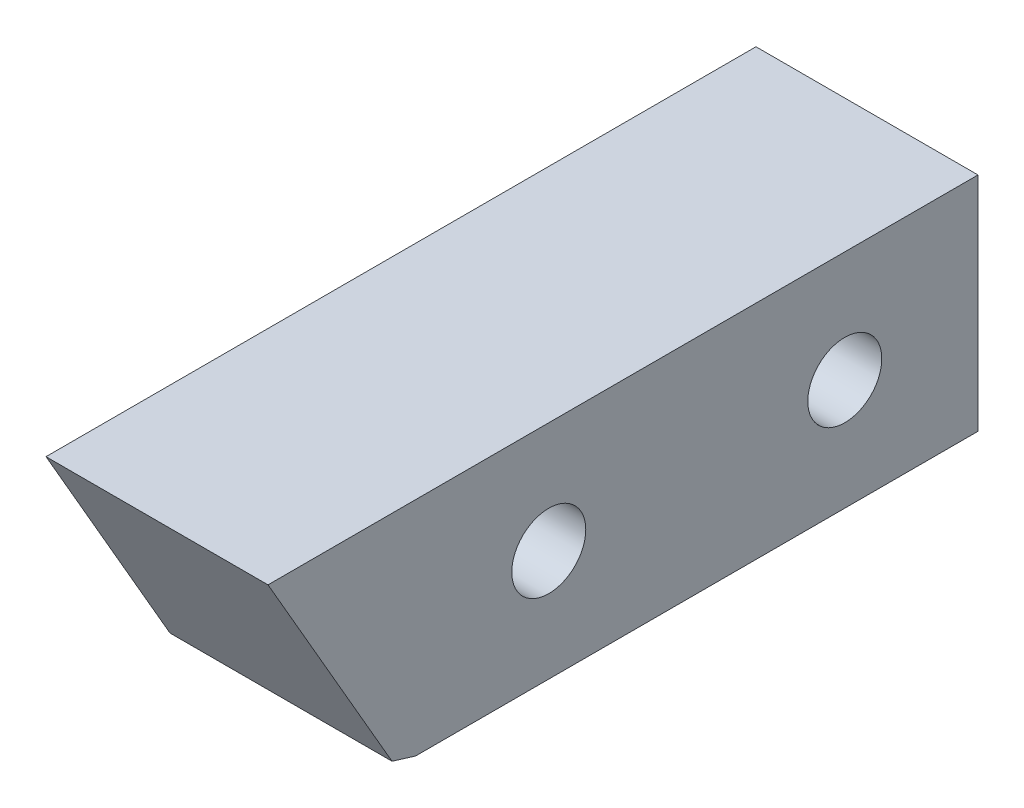
ISO-10303-21;
HEADER;
FILE_DESCRIPTION(('STEP AP214'),'2;1');
FILE_NAME('part.step','',(''),(''),'','','');
FILE_SCHEMA(('AUTOMOTIVE_DESIGN { 1 0 10303 214 1 1 1 1 }'));
ENDSEC;
DATA;
#1=APPLICATION_CONTEXT('core data for automotive mechanical design processes');
#2=APPLICATION_PROTOCOL_DEFINITION('international standard','automotive_design',2000,#1);
#3=PRODUCT_CONTEXT('',#1,'mechanical');
#4=PRODUCT('Part','Part','',(#3));
#5=PRODUCT_RELATED_PRODUCT_CATEGORY('part','',(#4));
#6=PRODUCT_DEFINITION_FORMATION('','',#4);
#7=PRODUCT_DEFINITION_CONTEXT('part definition',#1,'design');
#8=PRODUCT_DEFINITION('design','',#6,#7);
#9=PRODUCT_DEFINITION_SHAPE('','',#8);
#10=(LENGTH_UNIT() NAMED_UNIT(*) SI_UNIT(.MILLI.,.METRE.));
#11=(NAMED_UNIT(*) PLANE_ANGLE_UNIT() SI_UNIT($,.RADIAN.));
#12=(NAMED_UNIT(*) SI_UNIT($,.STERADIAN.) SOLID_ANGLE_UNIT());
#13=UNCERTAINTY_MEASURE_WITH_UNIT(LENGTH_MEASURE(1.E-05),#10,'distance_accuracy_value','');
#14=(GEOMETRIC_REPRESENTATION_CONTEXT(3) GLOBAL_UNCERTAINTY_ASSIGNED_CONTEXT((#13)) GLOBAL_UNIT_ASSIGNED_CONTEXT((#10,
#11,#12)) REPRESENTATION_CONTEXT('',''));
#15=CARTESIAN_POINT('',(0.,0.,0.));
#16=DIRECTION('',(0.,0.,1.));
#17=DIRECTION('',(1.,0.,0.));
#18=AXIS2_PLACEMENT_3D('',#15,#16,#17);
#19=CARTESIAN_POINT('',(4.7625,9.525,12.065));
#20=DIRECTION('',(-1.,0.,0.));
#21=DIRECTION('',(0.,0.,1.));
#22=AXIS2_PLACEMENT_3D('',#19,#20,#21);
#23=PLANE('',#22);
#24=CARTESIAN_POINT('',(4.7625,4.7625,-6.35));
#25=DIRECTION('',(1.,0.,0.));
#26=DIRECTION('',(0.,0.,1.));
#27=AXIS2_PLACEMENT_3D('',#24,#25,#26);
#28=CIRCLE('',#27,1.5875);
#29=CARTESIAN_POINT('',(4.7625,4.7625,-4.7625));
#30=VERTEX_POINT('',#29);
#31=EDGE_CURVE('E101',#30,#30,#28,.T.);
#32=ORIENTED_EDGE('',*,*,#31,.F.);
#33=EDGE_LOOP('',(#32));
#34=FACE_BOUND('',#33,.T.);
#35=CARTESIAN_POINT('',(4.7625,4.7625,6.35));
#36=DIRECTION('',(1.,0.,0.));
#37=DIRECTION('',(0.,0.,-1.));
#38=AXIS2_PLACEMENT_3D('',#35,#36,#37);
#39=CIRCLE('',#38,1.5875);
#40=CARTESIAN_POINT('',(4.7625,4.7625,4.7625));
#41=VERTEX_POINT('',#40);
#42=EDGE_CURVE('E108',#41,#41,#39,.T.);
#43=ORIENTED_EDGE('',*,*,#42,.F.);
#44=EDGE_LOOP('',(#43));
#45=FACE_BOUND('',#44,.T.);
#46=DIRECTION('',(0.,0.,-1.));
#47=VECTOR('',#46,1.);
#48=CARTESIAN_POINT('',(4.7625,0.,12.065));
#49=LINE('',#48,#47);
#50=CARTESIAN_POINT('',(4.7625,0.,12.065));
#51=VERTEX_POINT('',#50);
#52=CARTESIAN_POINT('',(4.7625,0.,-12.065));
#53=VERTEX_POINT('',#52);
#54=EDGE_CURVE('E64',#51,#53,#49,.T.);
#55=ORIENTED_EDGE('',*,*,#54,.T.);
#56=DIRECTION('',(0.,-1.,0.));
#57=VECTOR('',#56,1.);
#58=CARTESIAN_POINT('',(4.7625,9.525,-12.065));
#59=LINE('',#58,#57);
#60=CARTESIAN_POINT('',(4.7625,9.525,-12.065));
#61=VERTEX_POINT('',#60);
#62=EDGE_CURVE('E11',#61,#53,#59,.T.);
#63=ORIENTED_EDGE('',*,*,#62,.F.);
#64=DIRECTION('',(0.,0.,-1.));
#65=VECTOR('',#64,1.);
#66=CARTESIAN_POINT('',(4.7625,9.525,12.065));
#67=LINE('',#66,#65);
#68=CARTESIAN_POINT('',(4.7625,9.525,18.3943204089087));
#69=VERTEX_POINT('',#68);
#70=EDGE_CURVE('E84',#69,#61,#67,.T.);
#71=ORIENTED_EDGE('',*,*,#70,.F.);
#72=DIRECTION('',(0.,-0.866025403784438,-0.5));
#73=VECTOR('',#72,1.);
#74=CARTESIAN_POINT('',(4.7625,9.525,18.3943204089087));
#75=LINE('',#74,#73);
#76=CARTESIAN_POINT('',(4.7625,0.310605346874417,13.0743871755072));
#77=VERTEX_POINT('',#76);
#78=EDGE_CURVE('E90',#69,#77,#75,.T.);
#79=ORIENTED_EDGE('',*,*,#78,.T.);
#80=DIRECTION('',(0.,-0.294107194574178,-0.95577244054205));
#81=VECTOR('',#80,1.);
#82=CARTESIAN_POINT('',(4.7625,0.310605346874417,13.0743871755072));
#83=LINE('',#82,#81);
#84=EDGE_CURVE('E81',#77,#51,#83,.T.);
#85=ORIENTED_EDGE('',*,*,#84,.T.);
#86=EDGE_LOOP('',(#55,#63,#71,#79,#85));
#87=FACE_BOUND('',#86,.T.);
#88=ADVANCED_FACE('F31',(#34,#45,#87),#23,.F.);
#89=CARTESIAN_POINT('',(-4.7625,9.525,-12.065));
#90=DIRECTION('',(0.,0.,1.));
#91=DIRECTION('',(1.,0.,0.));
#92=AXIS2_PLACEMENT_3D('',#89,#90,#91);
#93=PLANE('',#92);
#94=DIRECTION('',(-1.,0.,0.));
#95=VECTOR('',#94,1.);
#96=CARTESIAN_POINT('',(-4.7625,0.,-12.065));
#97=LINE('',#96,#95);
#98=CARTESIAN_POINT('',(-4.7625,0.,-12.065));
#99=VERTEX_POINT('',#98);
#100=EDGE_CURVE('E58',#53,#99,#97,.T.);
#101=ORIENTED_EDGE('',*,*,#100,.T.);
#102=DIRECTION('',(0.,-1.,0.));
#103=VECTOR('',#102,1.);
#104=CARTESIAN_POINT('',(-4.7625,9.525,-12.065));
#105=LINE('',#104,#103);
#106=CARTESIAN_POINT('',(-4.7625,9.525,-12.065));
#107=VERTEX_POINT('',#106);
#108=EDGE_CURVE('E39',#107,#99,#105,.T.);
#109=ORIENTED_EDGE('',*,*,#108,.F.);
#110=DIRECTION('',(-1.,0.,0.));
#111=VECTOR('',#110,1.);
#112=CARTESIAN_POINT('',(-4.7625,9.525,-12.065));
#113=LINE('',#112,#111);
#114=EDGE_CURVE('E47',#61,#107,#113,.T.);
#115=ORIENTED_EDGE('',*,*,#114,.F.);
#116=ORIENTED_EDGE('',*,*,#62,.T.);
#117=EDGE_LOOP('',(#101,#109,#115,#116));
#118=FACE_BOUND('',#117,.T.);
#119=ADVANCED_FACE('F124',(#118),#93,.F.);
#120=CARTESIAN_POINT('',(-4.7625,9.525,12.065));
#121=DIRECTION('',(1.,0.,0.));
#122=DIRECTION('',(0.,0.,-1.));
#123=AXIS2_PLACEMENT_3D('',#120,#121,#122);
#124=PLANE('',#123);
#125=CARTESIAN_POINT('',(-4.7625,4.7625,-6.35));
#126=DIRECTION('',(1.,0.,0.));
#127=DIRECTION('',(0.,0.,1.));
#128=AXIS2_PLACEMENT_3D('',#125,#126,#127);
#129=CIRCLE('',#128,1.5875);
#130=CARTESIAN_POINT('',(-4.7625,4.7625,-4.7625));
#131=VERTEX_POINT('',#130);
#132=EDGE_CURVE('E105',#131,#131,#129,.T.);
#133=ORIENTED_EDGE('',*,*,#132,.T.);
#134=EDGE_LOOP('',(#133));
#135=FACE_BOUND('',#134,.T.);
#136=CARTESIAN_POINT('',(-4.7625,4.7625,6.35));
#137=DIRECTION('',(1.,0.,0.));
#138=DIRECTION('',(0.,0.,-1.));
#139=AXIS2_PLACEMENT_3D('',#136,#137,#138);
#140=CIRCLE('',#139,1.5875);
#141=CARTESIAN_POINT('',(-4.7625,4.7625,4.7625));
#142=VERTEX_POINT('',#141);
#143=EDGE_CURVE('E73',#142,#142,#140,.T.);
#144=ORIENTED_EDGE('',*,*,#143,.T.);
#145=EDGE_LOOP('',(#144));
#146=FACE_BOUND('',#145,.T.);
#147=DIRECTION('',(0.,0.,1.));
#148=VECTOR('',#147,1.);
#149=CARTESIAN_POINT('',(-4.7625,0.,12.065));
#150=LINE('',#149,#148);
#151=CARTESIAN_POINT('',(-4.7625,0.,12.065));
#152=VERTEX_POINT('',#151);
#153=EDGE_CURVE('E85',#99,#152,#150,.T.);
#154=ORIENTED_EDGE('',*,*,#153,.T.);
#155=DIRECTION('',(0.,-0.294107194574178,-0.95577244054205));
#156=VECTOR('',#155,1.);
#157=CARTESIAN_POINT('',(-4.7625,0.310605346874417,13.0743871755072));
#158=LINE('',#157,#156);
#159=CARTESIAN_POINT('',(-4.7625,0.310605346874417,13.0743871755072));
#160=VERTEX_POINT('',#159);
#161=EDGE_CURVE('E83',#160,#152,#158,.T.);
#162=ORIENTED_EDGE('',*,*,#161,.F.);
#163=DIRECTION('',(0.,-0.866025403784438,-0.5));
#164=VECTOR('',#163,1.);
#165=CARTESIAN_POINT('',(-4.7625,9.525,18.3943204089087));
#166=LINE('',#165,#164);
#167=CARTESIAN_POINT('',(-4.7625,9.525,18.3943204089087));
#168=VERTEX_POINT('',#167);
#169=EDGE_CURVE('E91',#168,#160,#166,.T.);
#170=ORIENTED_EDGE('',*,*,#169,.F.);
#171=DIRECTION('',(0.,0.,1.));
#172=VECTOR('',#171,1.);
#173=CARTESIAN_POINT('',(-4.7625,9.525,12.065));
#174=LINE('',#173,#172);
#175=EDGE_CURVE('E117',#107,#168,#174,.T.);
#176=ORIENTED_EDGE('',*,*,#175,.F.);
#177=ORIENTED_EDGE('',*,*,#108,.T.);
#178=EDGE_LOOP('',(#154,#162,#170,#176,#177));
#179=FACE_BOUND('',#178,.T.);
#180=ADVANCED_FACE('F122',(#135,#146,#179),#124,.F.);
#181=CARTESIAN_POINT('',(4.7625,9.525,-12.065));
#182=DIRECTION('',(0.,-1.,0.));
#183=DIRECTION('',(0.,0.,-1.));
#184=AXIS2_PLACEMENT_3D('',#181,#182,#183);
#185=PLANE('',#184);
#186=ORIENTED_EDGE('',*,*,#70,.T.);
#187=ORIENTED_EDGE('',*,*,#114,.T.);
#188=ORIENTED_EDGE('',*,*,#175,.T.);
#189=DIRECTION('',(1.,0.,0.));
#190=VECTOR('',#189,1.);
#191=CARTESIAN_POINT('',(-4.7625,9.525,18.3943204089087));
#192=LINE('',#191,#190);
#193=EDGE_CURVE('E102',#168,#69,#192,.T.);
#194=ORIENTED_EDGE('',*,*,#193,.T.);
#195=EDGE_LOOP('',(#186,#187,#188,#194));
#196=FACE_BOUND('',#195,.T.);
#197=ADVANCED_FACE('F125',(#196),#185,.F.);
#198=CARTESIAN_POINT('',(4.7625,0.,-12.065));
#199=DIRECTION('',(0.,-1.,0.));
#200=DIRECTION('',(0.,0.,-1.));
#201=AXIS2_PLACEMENT_3D('',#198,#199,#200);
#202=PLANE('',#201);
#203=ORIENTED_EDGE('',*,*,#54,.F.);
#204=DIRECTION('',(1.,0.,0.));
#205=VECTOR('',#204,1.);
#206=CARTESIAN_POINT('',(-4.7625,0.,12.065));
#207=LINE('',#206,#205);
#208=EDGE_CURVE('E68',#152,#51,#207,.T.);
#209=ORIENTED_EDGE('',*,*,#208,.F.);
#210=ORIENTED_EDGE('',*,*,#153,.F.);
#211=ORIENTED_EDGE('',*,*,#100,.F.);
#212=EDGE_LOOP('',(#203,#209,#210,#211));
#213=FACE_BOUND('',#212,.T.);
#214=ADVANCED_FACE('F66',(#213),#202,.T.);
#215=CARTESIAN_POINT('',(-4.7625,4.7625,6.35));
#216=DIRECTION('',(1.,0.,0.));
#217=DIRECTION('',(0.,0.,-1.));
#218=AXIS2_PLACEMENT_3D('',#215,#216,#217);
#219=CYLINDRICAL_SURFACE('',#218,1.5875);
#220=ORIENTED_EDGE('',*,*,#143,.F.);
#221=EDGE_LOOP('',(#220));
#222=FACE_BOUND('',#221,.T.);
#223=ORIENTED_EDGE('',*,*,#42,.T.);
#224=EDGE_LOOP('',(#223));
#225=FACE_BOUND('',#224,.T.);
#226=ADVANCED_FACE('F153',(#222,#225),#219,.F.);
#227=CARTESIAN_POINT('',(-4.7625,4.7625,-6.35));
#228=DIRECTION('',(1.,0.,0.));
#229=DIRECTION('',(0.,0.,-1.));
#230=AXIS2_PLACEMENT_3D('',#227,#228,#229);
#231=CYLINDRICAL_SURFACE('',#230,1.5875);
#232=ORIENTED_EDGE('',*,*,#132,.F.);
#233=EDGE_LOOP('',(#232));
#234=FACE_BOUND('',#233,.T.);
#235=ORIENTED_EDGE('',*,*,#31,.T.);
#236=EDGE_LOOP('',(#235));
#237=FACE_BOUND('',#236,.T.);
#238=ADVANCED_FACE('F141',(#234,#237),#231,.F.);
#239=CARTESIAN_POINT('',(-4.7625,0.310605346874417,13.0743871755072));
#240=DIRECTION('',(0.,-0.95577244054205,0.294107194574178));
#241=DIRECTION('',(0.,-0.294107194574178,-0.95577244054205));
#242=AXIS2_PLACEMENT_3D('',#239,#240,#241);
#243=PLANE('',#242);
#244=ORIENTED_EDGE('',*,*,#84,.F.);
#245=DIRECTION('',(1.,0.,0.));
#246=VECTOR('',#245,1.);
#247=CARTESIAN_POINT('',(-4.7625,0.310605346874417,13.0743871755072));
#248=LINE('',#247,#246);
#249=EDGE_CURVE('E98',#160,#77,#248,.T.);
#250=ORIENTED_EDGE('',*,*,#249,.F.);
#251=ORIENTED_EDGE('',*,*,#161,.T.);
#252=ORIENTED_EDGE('',*,*,#208,.T.);
#253=EDGE_LOOP('',(#244,#250,#251,#252));
#254=FACE_BOUND('',#253,.T.);
#255=ADVANCED_FACE('F78',(#254),#243,.T.);
#256=CARTESIAN_POINT('',(-4.7625,9.525,18.3943204089087));
#257=DIRECTION('',(0.,-0.5,0.866025403784439));
#258=DIRECTION('',(0.,-0.866025403784439,-0.5));
#259=AXIS2_PLACEMENT_3D('',#256,#257,#258);
#260=PLANE('',#259);
#261=ORIENTED_EDGE('',*,*,#78,.F.);
#262=ORIENTED_EDGE('',*,*,#193,.F.);
#263=ORIENTED_EDGE('',*,*,#169,.T.);
#264=ORIENTED_EDGE('',*,*,#249,.T.);
#265=EDGE_LOOP('',(#261,#262,#263,#264));
#266=FACE_BOUND('',#265,.T.);
#267=ADVANCED_FACE('F135',(#266),#260,.T.);
#268=CLOSED_SHELL('',(#88,#119,#180,#197,#214,#226,#238,#255,#267));
#269=MANIFOLD_SOLID_BREP('B2',#268);
#270=ADVANCED_BREP_SHAPE_REPRESENTATION('',(#18,#269),#14);
#271=SHAPE_DEFINITION_REPRESENTATION(#9,#270);
ENDSEC;
END-ISO-10303-21;
